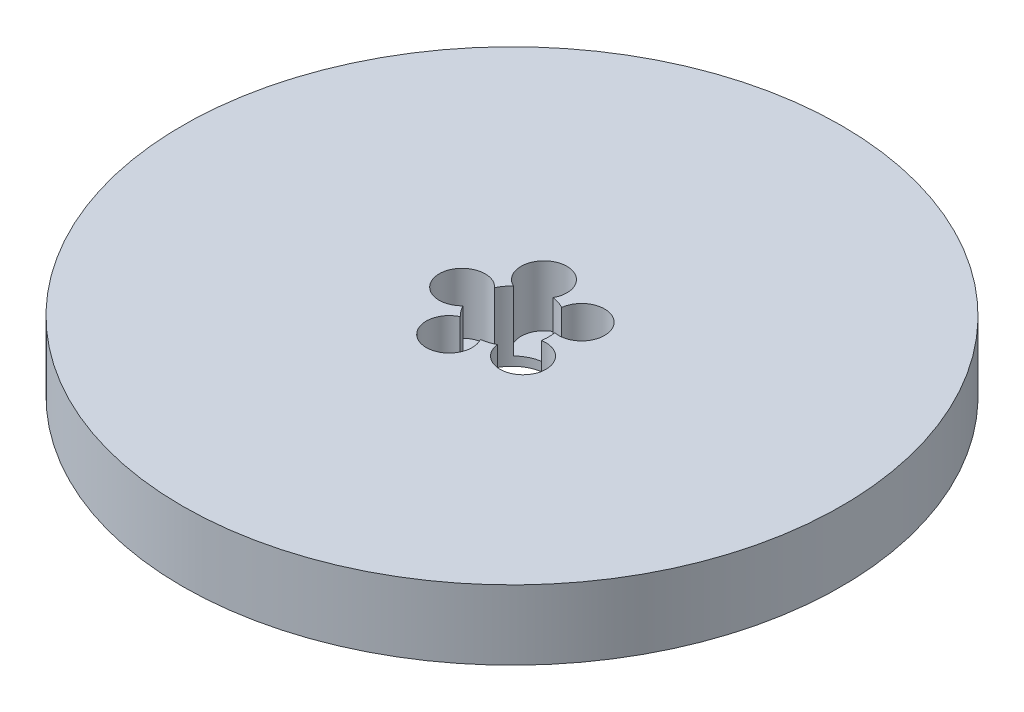
ISO-10303-21;
HEADER;
FILE_DESCRIPTION(('STEP AP214'),'2;1');
FILE_NAME('part.step','',(''),(''),'','','');
FILE_SCHEMA(('AUTOMOTIVE_DESIGN { 1 0 10303 214 1 1 1 1 }'));
ENDSEC;
DATA;
#1=APPLICATION_CONTEXT('core data for automotive mechanical design processes');
#2=APPLICATION_PROTOCOL_DEFINITION('international standard','automotive_design',2000,#1);
#3=PRODUCT_CONTEXT('',#1,'mechanical');
#4=PRODUCT('Part','Part','',(#3));
#5=PRODUCT_RELATED_PRODUCT_CATEGORY('part','',(#4));
#6=PRODUCT_DEFINITION_FORMATION('','',#4);
#7=PRODUCT_DEFINITION_CONTEXT('part definition',#1,'design');
#8=PRODUCT_DEFINITION('design','',#6,#7);
#9=PRODUCT_DEFINITION_SHAPE('','',#8);
#10=(LENGTH_UNIT() NAMED_UNIT(*) SI_UNIT(.MILLI.,.METRE.));
#11=(NAMED_UNIT(*) PLANE_ANGLE_UNIT() SI_UNIT($,.RADIAN.));
#12=(NAMED_UNIT(*) SI_UNIT($,.STERADIAN.) SOLID_ANGLE_UNIT());
#13=UNCERTAINTY_MEASURE_WITH_UNIT(LENGTH_MEASURE(1.E-05),#10,'distance_accuracy_value','');
#14=(GEOMETRIC_REPRESENTATION_CONTEXT(3) GLOBAL_UNCERTAINTY_ASSIGNED_CONTEXT((#13)) GLOBAL_UNIT_ASSIGNED_CONTEXT((#10,
#11,#12)) REPRESENTATION_CONTEXT('',''));
#15=CARTESIAN_POINT('',(0.,0.,0.));
#16=DIRECTION('',(0.,0.,1.));
#17=DIRECTION('',(1.,0.,0.));
#18=AXIS2_PLACEMENT_3D('',#15,#16,#17);
#19=CARTESIAN_POINT('',(0.,19.,0.));
#20=DIRECTION('',(0.,-1.,0.));
#21=DIRECTION('',(0.,0.,-1.));
#22=AXIS2_PLACEMENT_3D('',#19,#20,#21);
#23=CYLINDRICAL_SURFACE('',#22,90.);
#24=CARTESIAN_POINT('',(0.,19.,0.));
#25=DIRECTION('',(0.,1.,0.));
#26=DIRECTION('',(0.,0.,1.));
#27=AXIS2_PLACEMENT_3D('',#24,#25,#26);
#28=CIRCLE('',#27,90.);
#29=CARTESIAN_POINT('',(0.,19.,90.));
#30=VERTEX_POINT('',#29);
#31=EDGE_CURVE('E157',#30,#30,#28,.T.);
#32=ORIENTED_EDGE('',*,*,#31,.F.);
#33=EDGE_LOOP('',(#32));
#34=FACE_BOUND('',#33,.T.);
#35=CARTESIAN_POINT('',(0.,0.,0.));
#36=DIRECTION('',(0.,1.,0.));
#37=DIRECTION('',(0.,0.,1.));
#38=AXIS2_PLACEMENT_3D('',#35,#36,#37);
#39=CIRCLE('',#38,90.);
#40=CARTESIAN_POINT('',(0.,0.,90.));
#41=VERTEX_POINT('',#40);
#42=EDGE_CURVE('E150',#41,#41,#39,.T.);
#43=ORIENTED_EDGE('',*,*,#42,.T.);
#44=EDGE_LOOP('',(#43));
#45=FACE_BOUND('',#44,.T.);
#46=ADVANCED_FACE('F39',(#34,#45),#23,.T.);
#47=CARTESIAN_POINT('',(0.,19.,0.));
#48=DIRECTION('',(0.,1.,0.));
#49=DIRECTION('',(0.,0.,1.));
#50=AXIS2_PLACEMENT_3D('',#47,#48,#49);
#51=PLANE('',#50);
#52=CARTESIAN_POINT('',(-4.20654829406787,19.,-12.9464244329848));
#53=DIRECTION('',(0.,1.,0.));
#54=DIRECTION('',(-0.95105651629515,0.,0.309016994374958));
#55=AXIS2_PLACEMENT_3D('',#52,#53,#54);
#56=CIRCLE('',#55,6.27719624328561);
#57=CARTESIAN_POINT('',(1.2908809470008,19.,-9.91633129643571));
#58=VERTEX_POINT('',#57);
#59=CARTESIAN_POINT('',(-6.87301791672985,19.,-7.26371975755607));
#60=VERTEX_POINT('',#59);
#61=EDGE_CURVE('E194',#58,#60,#56,.T.);
#62=ORIENTED_EDGE('',*,*,#61,.F.);
#63=CARTESIAN_POINT('',(0.,19.,0.));
#64=DIRECTION('',(0.,1.,0.));
#65=DIRECTION('',(0.,0.,1.));
#66=AXIS2_PLACEMENT_3D('',#63,#64,#65);
#67=CIRCLE('',#66,10.);
#68=CARTESIAN_POINT('',(4.78432866905256,19.,-8.78124132378115));
#69=VERTEX_POINT('',#68);
#70=EDGE_CURVE('E147',#69,#58,#67,.T.);
#71=ORIENTED_EDGE('',*,*,#70,.F.);
#72=CARTESIAN_POINT('',(11.0128864091871,19.,-8.00133033236683));
#73=DIRECTION('',(0.,1.,0.));
#74=DIRECTION('',(-0.58778525229248,0.,-0.809016994374942));
#75=AXIS2_PLACEMENT_3D('',#72,#73,#74);
#76=CIRCLE('',#75,6.27719624328561);
#77=CARTESIAN_POINT('',(9.82989564755483,19.,-1.83661415604439));
#78=VERTEX_POINT('',#77);
#79=EDGE_CURVE('E254',#78,#69,#76,.T.);
#80=ORIENTED_EDGE('',*,*,#79,.F.);
#81=CARTESIAN_POINT('',(9.82989564755485,19.,1.83661415604424));
#82=VERTEX_POINT('',#81);
#83=EDGE_CURVE('E144',#82,#78,#67,.T.);
#84=ORIENTED_EDGE('',*,*,#83,.F.);
#85=CARTESIAN_POINT('',(11.0128864091872,19.,8.00133033236667));
#86=DIRECTION('',(0.,1.,0.));
#87=DIRECTION('',(0.587785252292469,0.,-0.809016994374951));
#88=AXIS2_PLACEMENT_3D('',#85,#86,#87);
#89=CIRCLE('',#88,6.27719624328561);
#90=CARTESIAN_POINT('',(4.78432866905268,19.,8.78124132378109));
#91=VERTEX_POINT('',#90);
#92=EDGE_CURVE('E141',#91,#82,#89,.T.);
#93=ORIENTED_EDGE('',*,*,#92,.F.);
#94=CARTESIAN_POINT('',(1.29088094700095,19.,9.91633129643569));
#95=VERTEX_POINT('',#94);
#96=EDGE_CURVE('E134',#95,#91,#67,.T.);
#97=ORIENTED_EDGE('',*,*,#96,.F.);
#98=CARTESIAN_POINT('',(-4.20654829406769,19.,12.9464244329849));
#99=DIRECTION('',(0.,1.,0.));
#100=DIRECTION('',(0.951056516295155,0.,0.309016994374945));
#101=AXIS2_PLACEMENT_3D('',#98,#99,#100);
#102=CIRCLE('',#101,6.27719624328561);
#103=CARTESIAN_POINT('',(-6.87301791672975,19.,7.26371975755617));
#104=VERTEX_POINT('',#103);
#105=EDGE_CURVE('E111',#104,#95,#102,.T.);
#106=ORIENTED_EDGE('',*,*,#105,.F.);
#107=CARTESIAN_POINT('',(-9.03208734687862,19.,4.29201562885727));
#108=VERTEX_POINT('',#107);
#109=EDGE_CURVE('E145',#108,#104,#67,.T.);
#110=ORIENTED_EDGE('',*,*,#109,.F.);
#111=CARTESIAN_POINT('',(-13.6126762302389,19.,0.));
#112=DIRECTION('',(0.,1.,0.));
#113=DIRECTION('',(0.,0.,1.));
#114=AXIS2_PLACEMENT_3D('',#111,#112,#113);
#115=CIRCLE('',#114,6.27719624328561);
#116=CARTESIAN_POINT('',(-9.03208734687862,19.,-4.29201562885727));
#117=VERTEX_POINT('',#116);
#118=EDGE_CURVE('E153',#117,#108,#115,.T.);
#119=ORIENTED_EDGE('',*,*,#118,.F.);
#120=EDGE_CURVE('E146',#60,#117,#67,.T.);
#121=ORIENTED_EDGE('',*,*,#120,.F.);
#122=EDGE_LOOP('',(#62,#71,#80,#84,#93,#97,#106,#110,#119,#121));
#123=FACE_BOUND('',#122,.T.);
#124=ORIENTED_EDGE('',*,*,#31,.T.);
#125=EDGE_LOOP('',(#124));
#126=FACE_BOUND('',#125,.T.);
#127=ADVANCED_FACE('F139',(#123,#126),#51,.T.);
#128=CARTESIAN_POINT('',(0.,0.,0.));
#129=DIRECTION('',(0.,1.,0.));
#130=DIRECTION('',(0.,0.,1.));
#131=AXIS2_PLACEMENT_3D('',#128,#129,#130);
#132=PLANE('',#131);
#133=CARTESIAN_POINT('',(0.,0.,0.));
#134=DIRECTION('',(0.,1.,0.));
#135=DIRECTION('',(0.,0.,1.));
#136=AXIS2_PLACEMENT_3D('',#133,#134,#135);
#137=CIRCLE('',#136,10.);
#138=CARTESIAN_POINT('',(0.,0.,10.));
#139=VERTEX_POINT('',#138);
#140=EDGE_CURVE('E154',#139,#139,#137,.T.);
#141=ORIENTED_EDGE('',*,*,#140,.T.);
#142=EDGE_LOOP('',(#141));
#143=FACE_BOUND('',#142,.T.);
#144=ORIENTED_EDGE('',*,*,#42,.F.);
#145=EDGE_LOOP('',(#144));
#146=FACE_BOUND('',#145,.T.);
#147=ADVANCED_FACE('F213',(#143,#146),#132,.F.);
#148=CARTESIAN_POINT('',(0.,19.,0.));
#149=DIRECTION('',(0.,-1.,0.));
#150=DIRECTION('',(0.,0.,-1.));
#151=AXIS2_PLACEMENT_3D('',#148,#149,#150);
#152=CYLINDRICAL_SURFACE('',#151,10.);
#153=DIRECTION('',(0.,1.,0.));
#154=VECTOR('',#153,1.);
#155=CARTESIAN_POINT('',(1.29088094700081,10.7251725136163,-9.91633129643571));
#156=LINE('',#155,#154);
#157=CARTESIAN_POINT('',(1.2908809470008,2.4503450272326,-9.91633129643571));
#158=VERTEX_POINT('',#157);
#159=EDGE_CURVE('E11',#158,#58,#156,.T.);
#160=ORIENTED_EDGE('',*,*,#159,.F.);
#161=CARTESIAN_POINT('',(0.,2.4503450272326,0.));
#162=DIRECTION('',(0.,1.,0.));
#163=DIRECTION('',(0.,0.,1.));
#164=AXIS2_PLACEMENT_3D('',#161,#162,#163);
#165=CIRCLE('',#164,10.);
#166=CARTESIAN_POINT('',(-6.87301791672985,2.4503450272326,-7.26371975755607));
#167=VERTEX_POINT('',#166);
#168=EDGE_CURVE('E189',#158,#167,#165,.T.);
#169=ORIENTED_EDGE('',*,*,#168,.T.);
#170=DIRECTION('',(0.,1.,0.));
#171=VECTOR('',#170,1.);
#172=CARTESIAN_POINT('',(-6.87301791672985,10.7251725136163,-7.26371975755607));
#173=LINE('',#172,#171);
#174=EDGE_CURVE('E46',#60,#167,#173,.F.);
#175=ORIENTED_EDGE('',*,*,#174,.F.);
#176=ORIENTED_EDGE('',*,*,#120,.T.);
#177=DIRECTION('',(0.,1.,0.));
#178=VECTOR('',#177,1.);
#179=CARTESIAN_POINT('',(-9.03208734687863,10.7251725136163,-4.29201562885727));
#180=LINE('',#179,#178);
#181=CARTESIAN_POINT('',(-9.03208734687862,2.4503450272326,-4.29201562885727));
#182=VERTEX_POINT('',#181);
#183=EDGE_CURVE('E168',#182,#117,#180,.T.);
#184=ORIENTED_EDGE('',*,*,#183,.F.);
#185=CARTESIAN_POINT('',(0.,2.4503450272326,0.));
#186=DIRECTION('',(0.,1.,0.));
#187=DIRECTION('',(0.,0.,1.));
#188=AXIS2_PLACEMENT_3D('',#185,#186,#187);
#189=CIRCLE('',#188,10.);
#190=CARTESIAN_POINT('',(-9.03208734687862,2.4503450272326,4.29201562885727));
#191=VERTEX_POINT('',#190);
#192=EDGE_CURVE('E165',#182,#191,#189,.T.);
#193=ORIENTED_EDGE('',*,*,#192,.T.);
#194=DIRECTION('',(0.,1.,0.));
#195=VECTOR('',#194,1.);
#196=CARTESIAN_POINT('',(-9.03208734687863,10.7251725136163,4.29201562885727));
#197=LINE('',#196,#195);
#198=EDGE_CURVE('E170',#108,#191,#197,.F.);
#199=ORIENTED_EDGE('',*,*,#198,.F.);
#200=ORIENTED_EDGE('',*,*,#109,.T.);
#201=DIRECTION('',(0.,1.,0.));
#202=VECTOR('',#201,1.);
#203=CARTESIAN_POINT('',(-6.87301791672975,10.7251725136163,7.26371975755617));
#204=LINE('',#203,#202);
#205=CARTESIAN_POINT('',(-6.87301791672975,2.4503450272326,7.26371975755617));
#206=VERTEX_POINT('',#205);
#207=EDGE_CURVE('E121',#206,#104,#204,.T.);
#208=ORIENTED_EDGE('',*,*,#207,.F.);
#209=CARTESIAN_POINT('',(0.,2.4503450272326,0.));
#210=DIRECTION('',(0.,1.,0.));
#211=DIRECTION('',(0.,0.,1.));
#212=AXIS2_PLACEMENT_3D('',#209,#210,#211);
#213=CIRCLE('',#212,10.);
#214=CARTESIAN_POINT('',(1.29088094700095,2.4503450272326,9.91633129643569));
#215=VERTEX_POINT('',#214);
#216=EDGE_CURVE('E136',#206,#215,#213,.T.);
#217=ORIENTED_EDGE('',*,*,#216,.T.);
#218=DIRECTION('',(0.,1.,0.));
#219=VECTOR('',#218,1.);
#220=CARTESIAN_POINT('',(1.29088094700095,10.7251725136163,9.91633129643569));
#221=LINE('',#220,#219);
#222=EDGE_CURVE('E117',#95,#215,#221,.F.);
#223=ORIENTED_EDGE('',*,*,#222,.F.);
#224=ORIENTED_EDGE('',*,*,#96,.T.);
#225=DIRECTION('',(0.,1.,0.));
#226=VECTOR('',#225,1.);
#227=CARTESIAN_POINT('',(4.78432866905268,10.7251725136163,8.78124132378109));
#228=LINE('',#227,#226);
#229=CARTESIAN_POINT('',(4.78432866905268,2.4503450272326,8.78124132378109));
#230=VERTEX_POINT('',#229);
#231=EDGE_CURVE('E182',#230,#91,#228,.T.);
#232=ORIENTED_EDGE('',*,*,#231,.F.);
#233=CARTESIAN_POINT('',(0.,2.4503450272326,0.));
#234=DIRECTION('',(0.,1.,0.));
#235=DIRECTION('',(0.,0.,1.));
#236=AXIS2_PLACEMENT_3D('',#233,#234,#235);
#237=CIRCLE('',#236,10.);
#238=CARTESIAN_POINT('',(9.82989564755485,2.4503450272326,1.83661415604424));
#239=VERTEX_POINT('',#238);
#240=EDGE_CURVE('E174',#230,#239,#237,.T.);
#241=ORIENTED_EDGE('',*,*,#240,.T.);
#242=DIRECTION('',(0.,1.,0.));
#243=VECTOR('',#242,1.);
#244=CARTESIAN_POINT('',(9.82989564755485,10.7251725136163,1.83661415604425));
#245=LINE('',#244,#243);
#246=EDGE_CURVE('E177',#82,#239,#245,.F.);
#247=ORIENTED_EDGE('',*,*,#246,.F.);
#248=ORIENTED_EDGE('',*,*,#83,.T.);
#249=DIRECTION('',(0.,1.,0.));
#250=VECTOR('',#249,1.);
#251=CARTESIAN_POINT('',(9.82989564755483,10.7251725136163,-1.83661415604439));
#252=LINE('',#251,#250);
#253=CARTESIAN_POINT('',(9.82989564755483,2.4503450272326,-1.83661415604439));
#254=VERTEX_POINT('',#253);
#255=EDGE_CURVE('E187',#254,#78,#252,.T.);
#256=ORIENTED_EDGE('',*,*,#255,.F.);
#257=CARTESIAN_POINT('',(0.,2.4503450272326,0.));
#258=DIRECTION('',(0.,1.,0.));
#259=DIRECTION('',(0.,0.,1.));
#260=AXIS2_PLACEMENT_3D('',#257,#258,#259);
#261=CIRCLE('',#260,10.);
#262=CARTESIAN_POINT('',(4.78432866905256,2.4503450272326,-8.78124132378115));
#263=VERTEX_POINT('',#262);
#264=EDGE_CURVE('E181',#254,#263,#261,.T.);
#265=ORIENTED_EDGE('',*,*,#264,.T.);
#266=DIRECTION('',(0.,1.,0.));
#267=VECTOR('',#266,1.);
#268=CARTESIAN_POINT('',(4.78432866905256,10.7251725136163,-8.78124132378115));
#269=LINE('',#268,#267);
#270=EDGE_CURVE('E186',#69,#263,#269,.F.);
#271=ORIENTED_EDGE('',*,*,#270,.F.);
#272=ORIENTED_EDGE('',*,*,#70,.T.);
#273=EDGE_LOOP('',(#160,#169,#175,#176,#184,#193,#199,#200,#208,#217,#223,#224,#232,#241,#247,
#248,#256,#265,#271,#272));
#274=FACE_BOUND('',#273,.T.);
#275=ORIENTED_EDGE('',*,*,#140,.F.);
#276=EDGE_LOOP('',(#275));
#277=FACE_BOUND('',#276,.T.);
#278=ADVANCED_FACE('F135',(#274,#277),#152,.F.);
#279=CARTESIAN_POINT('',(-13.6126762302389,2.4503450272326,0.));
#280=DIRECTION('',(0.,1.,0.));
#281=DIRECTION('',(0.,0.,1.));
#282=AXIS2_PLACEMENT_3D('',#279,#280,#281);
#283=CYLINDRICAL_SURFACE('',#282,6.27719624328561);
#284=ORIENTED_EDGE('',*,*,#183,.T.);
#285=ORIENTED_EDGE('',*,*,#118,.T.);
#286=ORIENTED_EDGE('',*,*,#198,.T.);
#287=CARTESIAN_POINT('',(-13.6126762302389,2.4503450272326,0.));
#288=DIRECTION('',(0.,1.,0.));
#289=DIRECTION('',(0.,0.,1.));
#290=AXIS2_PLACEMENT_3D('',#287,#288,#289);
#291=CIRCLE('',#290,6.27719624328561);
#292=EDGE_CURVE('E158',#182,#191,#291,.T.);
#293=ORIENTED_EDGE('',*,*,#292,.F.);
#294=EDGE_LOOP('',(#284,#285,#286,#293));
#295=FACE_BOUND('',#294,.T.);
#296=ADVANCED_FACE('F221',(#295),#283,.F.);
#297=CARTESIAN_POINT('',(-13.6126762302389,2.4503450272326,0.));
#298=DIRECTION('',(0.,1.,0.));
#299=DIRECTION('',(0.,0.,1.));
#300=AXIS2_PLACEMENT_3D('',#297,#298,#299);
#301=PLANE('',#300);
#302=ORIENTED_EDGE('',*,*,#292,.T.);
#303=ORIENTED_EDGE('',*,*,#192,.F.);
#304=EDGE_LOOP('',(#302,#303));
#305=FACE_BOUND('',#304,.T.);
#306=ADVANCED_FACE('F227',(#305),#301,.T.);
#307=CARTESIAN_POINT('',(-4.20654829406769,2.4503450272326,12.9464244329849));
#308=DIRECTION('',(0.,1.,0.));
#309=DIRECTION('',(0.,0.,1.));
#310=AXIS2_PLACEMENT_3D('',#307,#308,#309);
#311=CYLINDRICAL_SURFACE('',#310,6.27719624328561);
#312=ORIENTED_EDGE('',*,*,#207,.T.);
#313=ORIENTED_EDGE('',*,*,#105,.T.);
#314=ORIENTED_EDGE('',*,*,#222,.T.);
#315=CARTESIAN_POINT('',(-4.20654829406769,2.4503450272326,12.9464244329849));
#316=DIRECTION('',(0.,1.,0.));
#317=DIRECTION('',(0.951056516295155,0.,0.309016994374945));
#318=AXIS2_PLACEMENT_3D('',#315,#316,#317);
#319=CIRCLE('',#318,6.27719624328561);
#320=EDGE_CURVE('E127',#206,#215,#319,.T.);
#321=ORIENTED_EDGE('',*,*,#320,.F.);
#322=EDGE_LOOP('',(#312,#313,#314,#321));
#323=FACE_BOUND('',#322,.T.);
#324=ADVANCED_FACE('F116',(#323),#311,.F.);
#325=CARTESIAN_POINT('',(-4.20654829406769,2.4503450272326,12.9464244329849));
#326=DIRECTION('',(0.,1.,0.));
#327=DIRECTION('',(0.951056516295155,0.,0.309016994374945));
#328=AXIS2_PLACEMENT_3D('',#325,#326,#327);
#329=PLANE('',#328);
#330=ORIENTED_EDGE('',*,*,#320,.T.);
#331=ORIENTED_EDGE('',*,*,#216,.F.);
#332=EDGE_LOOP('',(#330,#331));
#333=FACE_BOUND('',#332,.T.);
#334=ADVANCED_FACE('F234',(#333),#329,.T.);
#335=CARTESIAN_POINT('',(11.0128864091872,2.4503450272326,8.00133033236667));
#336=DIRECTION('',(0.,1.,0.));
#337=DIRECTION('',(0.,0.,1.));
#338=AXIS2_PLACEMENT_3D('',#335,#336,#337);
#339=CYLINDRICAL_SURFACE('',#338,6.27719624328561);
#340=ORIENTED_EDGE('',*,*,#231,.T.);
#341=ORIENTED_EDGE('',*,*,#92,.T.);
#342=ORIENTED_EDGE('',*,*,#246,.T.);
#343=CARTESIAN_POINT('',(11.0128864091872,2.4503450272326,8.00133033236667));
#344=DIRECTION('',(0.,1.,0.));
#345=DIRECTION('',(0.587785252292469,0.,-0.809016994374951));
#346=AXIS2_PLACEMENT_3D('',#343,#344,#345);
#347=CIRCLE('',#346,6.27719624328561);
#348=EDGE_CURVE('E130',#230,#239,#347,.T.);
#349=ORIENTED_EDGE('',*,*,#348,.F.);
#350=EDGE_LOOP('',(#340,#341,#342,#349));
#351=FACE_BOUND('',#350,.T.);
#352=ADVANCED_FACE('F240',(#351),#339,.F.);
#353=CARTESIAN_POINT('',(11.0128864091872,2.4503450272326,8.00133033236667));
#354=DIRECTION('',(0.,1.,0.));
#355=DIRECTION('',(0.587785252292469,0.,-0.809016994374951));
#356=AXIS2_PLACEMENT_3D('',#353,#354,#355);
#357=PLANE('',#356);
#358=ORIENTED_EDGE('',*,*,#348,.T.);
#359=ORIENTED_EDGE('',*,*,#240,.F.);
#360=EDGE_LOOP('',(#358,#359));
#361=FACE_BOUND('',#360,.T.);
#362=ADVANCED_FACE('F245',(#361),#357,.T.);
#363=CARTESIAN_POINT('',(11.0128864091871,2.4503450272326,-8.00133033236683));
#364=DIRECTION('',(0.,1.,0.));
#365=DIRECTION('',(0.,0.,1.));
#366=AXIS2_PLACEMENT_3D('',#363,#364,#365);
#367=CYLINDRICAL_SURFACE('',#366,6.27719624328561);
#368=ORIENTED_EDGE('',*,*,#255,.T.);
#369=ORIENTED_EDGE('',*,*,#79,.T.);
#370=ORIENTED_EDGE('',*,*,#270,.T.);
#371=CARTESIAN_POINT('',(11.0128864091871,2.4503450272326,-8.00133033236683));
#372=DIRECTION('',(0.,1.,0.));
#373=DIRECTION('',(-0.58778525229248,0.,-0.809016994374942));
#374=AXIS2_PLACEMENT_3D('',#371,#372,#373);
#375=CIRCLE('',#374,6.27719624328561);
#376=EDGE_CURVE('E56',#254,#263,#375,.T.);
#377=ORIENTED_EDGE('',*,*,#376,.F.);
#378=EDGE_LOOP('',(#368,#369,#370,#377));
#379=FACE_BOUND('',#378,.T.);
#380=ADVANCED_FACE('F266',(#379),#367,.F.);
#381=CARTESIAN_POINT('',(11.0128864091871,2.4503450272326,-8.00133033236683));
#382=DIRECTION('',(0.,1.,0.));
#383=DIRECTION('',(-0.58778525229248,0.,-0.809016994374942));
#384=AXIS2_PLACEMENT_3D('',#381,#382,#383);
#385=PLANE('',#384);
#386=ORIENTED_EDGE('',*,*,#376,.T.);
#387=ORIENTED_EDGE('',*,*,#264,.F.);
#388=EDGE_LOOP('',(#386,#387));
#389=FACE_BOUND('',#388,.T.);
#390=ADVANCED_FACE('F204',(#389),#385,.T.);
#391=CARTESIAN_POINT('',(-4.20654829406787,2.4503450272326,-12.9464244329848));
#392=DIRECTION('',(0.,1.,0.));
#393=DIRECTION('',(0.,0.,1.));
#394=AXIS2_PLACEMENT_3D('',#391,#392,#393);
#395=CYLINDRICAL_SURFACE('',#394,6.27719624328561);
#396=ORIENTED_EDGE('',*,*,#159,.T.);
#397=ORIENTED_EDGE('',*,*,#61,.T.);
#398=ORIENTED_EDGE('',*,*,#174,.T.);
#399=CARTESIAN_POINT('',(-4.20654829406787,2.4503450272326,-12.9464244329848));
#400=DIRECTION('',(0.,1.,0.));
#401=DIRECTION('',(-0.95105651629515,0.,0.309016994374958));
#402=AXIS2_PLACEMENT_3D('',#399,#400,#401);
#403=CIRCLE('',#402,6.27719624328561);
#404=EDGE_CURVE('E55',#158,#167,#403,.T.);
#405=ORIENTED_EDGE('',*,*,#404,.F.);
#406=EDGE_LOOP('',(#396,#397,#398,#405));
#407=FACE_BOUND('',#406,.T.);
#408=ADVANCED_FACE('F193',(#407),#395,.F.);
#409=CARTESIAN_POINT('',(-4.20654829406787,2.4503450272326,-12.9464244329848));
#410=DIRECTION('',(0.,1.,0.));
#411=DIRECTION('',(-0.95105651629515,0.,0.309016994374958));
#412=AXIS2_PLACEMENT_3D('',#409,#410,#411);
#413=PLANE('',#412);
#414=ORIENTED_EDGE('',*,*,#404,.T.);
#415=ORIENTED_EDGE('',*,*,#168,.F.);
#416=EDGE_LOOP('',(#414,#415));
#417=FACE_BOUND('',#416,.T.);
#418=ADVANCED_FACE('F196',(#417),#413,.T.);
#419=CLOSED_SHELL('',(#46,#127,#147,#278,#296,#306,#324,#334,#352,#362,#380,#390,#408,#418));
#420=MANIFOLD_SOLID_BREP('B2',#419);
#421=ADVANCED_BREP_SHAPE_REPRESENTATION('',(#18,#420),#14);
#422=SHAPE_DEFINITION_REPRESENTATION(#9,#421);
ENDSEC;
END-ISO-10303-21;
